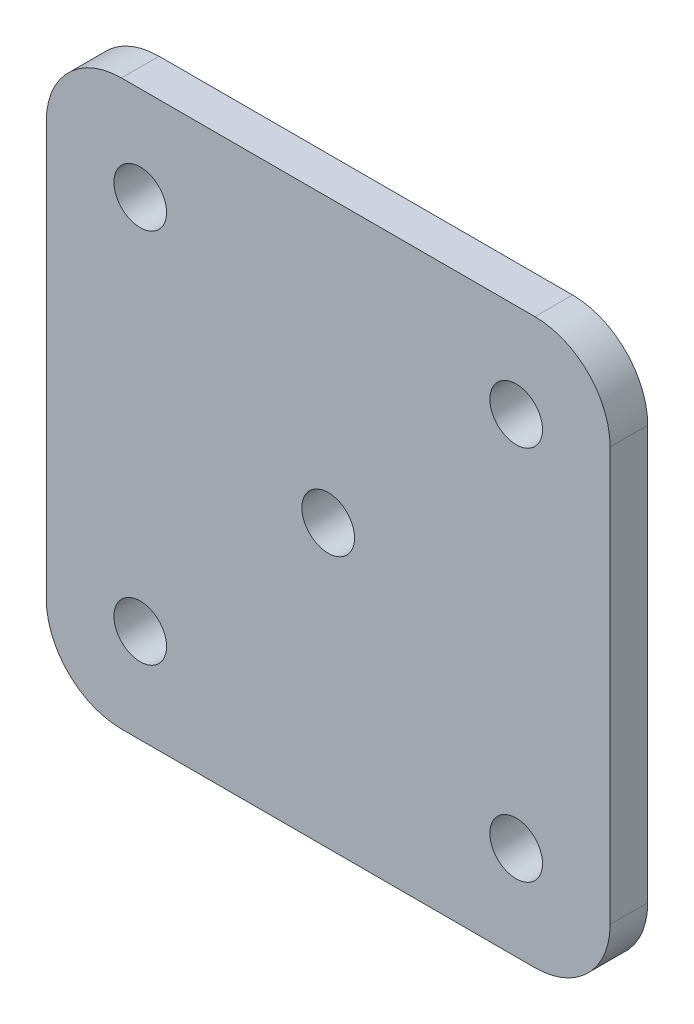
ISO-10303-21;
HEADER;
FILE_DESCRIPTION(('STEP AP214'),'2;1');
FILE_NAME('part.step','',(''),(''),'','','');
FILE_SCHEMA(('AUTOMOTIVE_DESIGN { 1 0 10303 214 1 1 1 1 }'));
ENDSEC;
DATA;
#1=APPLICATION_CONTEXT('core data for automotive mechanical design processes');
#2=APPLICATION_PROTOCOL_DEFINITION('international standard','automotive_design',2000,#1);
#3=PRODUCT_CONTEXT('',#1,'mechanical');
#4=PRODUCT('Part','Part','',(#3));
#5=PRODUCT_RELATED_PRODUCT_CATEGORY('part','',(#4));
#6=PRODUCT_DEFINITION_FORMATION('','',#4);
#7=PRODUCT_DEFINITION_CONTEXT('part definition',#1,'design');
#8=PRODUCT_DEFINITION('design','',#6,#7);
#9=PRODUCT_DEFINITION_SHAPE('','',#8);
#10=(LENGTH_UNIT() NAMED_UNIT(*) SI_UNIT(.MILLI.,.METRE.));
#11=(NAMED_UNIT(*) PLANE_ANGLE_UNIT() SI_UNIT($,.RADIAN.));
#12=(NAMED_UNIT(*) SI_UNIT($,.STERADIAN.) SOLID_ANGLE_UNIT());
#13=UNCERTAINTY_MEASURE_WITH_UNIT(LENGTH_MEASURE(1.E-05),#10,'distance_accuracy_value','');
#14=(GEOMETRIC_REPRESENTATION_CONTEXT(3) GLOBAL_UNCERTAINTY_ASSIGNED_CONTEXT((#13)) GLOBAL_UNIT_ASSIGNED_CONTEXT((#10,
#11,#12)) REPRESENTATION_CONTEXT('',''));
#15=CARTESIAN_POINT('',(0.,0.,0.));
#16=DIRECTION('',(0.,0.,1.));
#17=DIRECTION('',(1.,0.,0.));
#18=AXIS2_PLACEMENT_3D('',#15,#16,#17);
#19=CARTESIAN_POINT('',(-37.5,37.5,5.));
#20=DIRECTION('',(1.,0.,0.));
#21=DIRECTION('',(0.,1.,0.));
#22=AXIS2_PLACEMENT_3D('',#19,#20,#21);
#23=PLANE('',#22);
#24=DIRECTION('',(0.,-1.,0.));
#25=VECTOR('',#24,1.);
#26=CARTESIAN_POINT('',(-37.5,37.5,5.));
#27=LINE('',#26,#25);
#28=CARTESIAN_POINT('',(-37.5,27.5,5.));
#29=VERTEX_POINT('',#28);
#30=CARTESIAN_POINT('',(-37.5,-27.5,5.));
#31=VERTEX_POINT('',#30);
#32=EDGE_CURVE('E123',#29,#31,#27,.T.);
#33=ORIENTED_EDGE('',*,*,#32,.F.);
#34=DIRECTION('',(0.,0.,-1.));
#35=VECTOR('',#34,1.);
#36=CARTESIAN_POINT('',(-37.5,27.5,5.));
#37=LINE('',#36,#35);
#38=CARTESIAN_POINT('',(-37.5,27.5,0.));
#39=VERTEX_POINT('',#38);
#40=EDGE_CURVE('E108',#29,#39,#37,.T.);
#41=ORIENTED_EDGE('',*,*,#40,.T.);
#42=DIRECTION('',(0.,-1.,0.));
#43=VECTOR('',#42,1.);
#44=CARTESIAN_POINT('',(-37.5,37.5,0.));
#45=LINE('',#44,#43);
#46=CARTESIAN_POINT('',(-37.5,-27.5,0.));
#47=VERTEX_POINT('',#46);
#48=EDGE_CURVE('E120',#39,#47,#45,.T.);
#49=ORIENTED_EDGE('',*,*,#48,.T.);
#50=DIRECTION('',(0.,0.,-1.));
#51=VECTOR('',#50,1.);
#52=CARTESIAN_POINT('',(-37.5,-27.5,5.));
#53=LINE('',#52,#51);
#54=EDGE_CURVE('E125',#47,#31,#53,.F.);
#55=ORIENTED_EDGE('',*,*,#54,.T.);
#56=EDGE_LOOP('',(#33,#41,#49,#55));
#57=FACE_BOUND('',#56,.T.);
#58=ADVANCED_FACE('F38',(#57),#23,.F.);
#59=CARTESIAN_POINT('',(-37.5,-37.5,5.));
#60=DIRECTION('',(0.,1.,0.));
#61=DIRECTION('',(-1.,0.,0.));
#62=AXIS2_PLACEMENT_3D('',#59,#60,#61);
#63=PLANE('',#62);
#64=DIRECTION('',(1.,0.,0.));
#65=VECTOR('',#64,1.);
#66=CARTESIAN_POINT('',(-37.5,-37.5,5.));
#67=LINE('',#66,#65);
#68=CARTESIAN_POINT('',(-27.5,-37.5,5.));
#69=VERTEX_POINT('',#68);
#70=CARTESIAN_POINT('',(27.5,-37.5,5.));
#71=VERTEX_POINT('',#70);
#72=EDGE_CURVE('E169',#69,#71,#67,.T.);
#73=ORIENTED_EDGE('',*,*,#72,.F.);
#74=DIRECTION('',(0.,0.,-1.));
#75=VECTOR('',#74,1.);
#76=CARTESIAN_POINT('',(-27.5,-37.5,5.));
#77=LINE('',#76,#75);
#78=CARTESIAN_POINT('',(-27.5,-37.5,0.));
#79=VERTEX_POINT('',#78);
#80=EDGE_CURVE('E162',#69,#79,#77,.T.);
#81=ORIENTED_EDGE('',*,*,#80,.T.);
#82=DIRECTION('',(1.,0.,0.));
#83=VECTOR('',#82,1.);
#84=CARTESIAN_POINT('',(-37.5,-37.5,0.));
#85=LINE('',#84,#83);
#86=CARTESIAN_POINT('',(27.5,-37.5,0.));
#87=VERTEX_POINT('',#86);
#88=EDGE_CURVE('E129',#79,#87,#85,.T.);
#89=ORIENTED_EDGE('',*,*,#88,.T.);
#90=DIRECTION('',(0.,0.,-1.));
#91=VECTOR('',#90,1.);
#92=CARTESIAN_POINT('',(27.5,-37.5,5.));
#93=LINE('',#92,#91);
#94=EDGE_CURVE('E160',#87,#71,#93,.F.);
#95=ORIENTED_EDGE('',*,*,#94,.T.);
#96=EDGE_LOOP('',(#73,#81,#89,#95));
#97=FACE_BOUND('',#96,.T.);
#98=ADVANCED_FACE('F167',(#97),#63,.F.);
#99=CARTESIAN_POINT('',(37.5,37.5,5.));
#100=DIRECTION('',(-1.,0.,0.));
#101=DIRECTION('',(0.,0.,1.));
#102=AXIS2_PLACEMENT_3D('',#99,#100,#101);
#103=PLANE('',#102);
#104=DIRECTION('',(0.,1.,0.));
#105=VECTOR('',#104,1.);
#106=CARTESIAN_POINT('',(37.5,37.5,5.));
#107=LINE('',#106,#105);
#108=CARTESIAN_POINT('',(37.5,-27.5,5.));
#109=VERTEX_POINT('',#108);
#110=CARTESIAN_POINT('',(37.5,27.5,5.));
#111=VERTEX_POINT('',#110);
#112=EDGE_CURVE('E177',#109,#111,#107,.T.);
#113=ORIENTED_EDGE('',*,*,#112,.F.);
#114=DIRECTION('',(0.,0.,-1.));
#115=VECTOR('',#114,1.);
#116=CARTESIAN_POINT('',(37.5,-27.5,5.));
#117=LINE('',#116,#115);
#118=CARTESIAN_POINT('',(37.5,-27.5,0.));
#119=VERTEX_POINT('',#118);
#120=EDGE_CURVE('E11',#109,#119,#117,.T.);
#121=ORIENTED_EDGE('',*,*,#120,.T.);
#122=DIRECTION('',(0.,1.,0.));
#123=VECTOR('',#122,1.);
#124=CARTESIAN_POINT('',(37.5,37.5,0.));
#125=LINE('',#124,#123);
#126=CARTESIAN_POINT('',(37.5,27.5,0.));
#127=VERTEX_POINT('',#126);
#128=EDGE_CURVE('E133',#119,#127,#125,.T.);
#129=ORIENTED_EDGE('',*,*,#128,.T.);
#130=DIRECTION('',(0.,0.,-1.));
#131=VECTOR('',#130,1.);
#132=CARTESIAN_POINT('',(37.5,27.5,5.));
#133=LINE('',#132,#131);
#134=EDGE_CURVE('E46',#127,#111,#133,.F.);
#135=ORIENTED_EDGE('',*,*,#134,.T.);
#136=EDGE_LOOP('',(#113,#121,#129,#135));
#137=FACE_BOUND('',#136,.T.);
#138=ADVANCED_FACE('F176',(#137),#103,.F.);
#139=CARTESIAN_POINT('',(-37.5,37.5,5.));
#140=DIRECTION('',(0.,-1.,0.));
#141=DIRECTION('',(1.,0.,0.));
#142=AXIS2_PLACEMENT_3D('',#139,#140,#141);
#143=PLANE('',#142);
#144=DIRECTION('',(-1.,0.,0.));
#145=VECTOR('',#144,1.);
#146=CARTESIAN_POINT('',(-37.5,37.5,0.));
#147=LINE('',#146,#145);
#148=CARTESIAN_POINT('',(27.5,37.5,0.));
#149=VERTEX_POINT('',#148);
#150=CARTESIAN_POINT('',(-27.5,37.5,0.));
#151=VERTEX_POINT('',#150);
#152=EDGE_CURVE('E143',#149,#151,#147,.T.);
#153=ORIENTED_EDGE('',*,*,#152,.T.);
#154=DIRECTION('',(0.,0.,-1.));
#155=VECTOR('',#154,1.);
#156=CARTESIAN_POINT('',(-27.5,37.5,5.));
#157=LINE('',#156,#155);
#158=CARTESIAN_POINT('',(-27.5,37.5,5.));
#159=VERTEX_POINT('',#158);
#160=EDGE_CURVE('E109',#151,#159,#157,.F.);
#161=ORIENTED_EDGE('',*,*,#160,.T.);
#162=DIRECTION('',(-1.,0.,0.));
#163=VECTOR('',#162,1.);
#164=CARTESIAN_POINT('',(-37.5,37.5,5.));
#165=LINE('',#164,#163);
#166=CARTESIAN_POINT('',(27.5,37.5,5.));
#167=VERTEX_POINT('',#166);
#168=EDGE_CURVE('E139',#167,#159,#165,.T.);
#169=ORIENTED_EDGE('',*,*,#168,.F.);
#170=DIRECTION('',(0.,0.,-1.));
#171=VECTOR('',#170,1.);
#172=CARTESIAN_POINT('',(27.5,37.5,5.));
#173=LINE('',#172,#171);
#174=EDGE_CURVE('E114',#167,#149,#173,.T.);
#175=ORIENTED_EDGE('',*,*,#174,.T.);
#176=EDGE_LOOP('',(#153,#161,#169,#175));
#177=FACE_BOUND('',#176,.T.);
#178=ADVANCED_FACE('F215',(#177),#143,.F.);
#179=CARTESIAN_POINT('',(0.,0.,5.));
#180=DIRECTION('',(0.,0.,1.));
#181=DIRECTION('',(1.,0.,0.));
#182=AXIS2_PLACEMENT_3D('',#179,#180,#181);
#183=PLANE('',#182);
#184=CARTESIAN_POINT('',(0.,0.,5.));
#185=DIRECTION('',(0.,0.,1.));
#186=DIRECTION('',(1.,0.,0.));
#187=AXIS2_PLACEMENT_3D('',#184,#185,#186);
#188=CIRCLE('',#187,3.5);
#189=CARTESIAN_POINT('',(3.5,0.,5.));
#190=VERTEX_POINT('',#189);
#191=EDGE_CURVE('E206',#190,#190,#188,.T.);
#192=ORIENTED_EDGE('',*,*,#191,.F.);
#193=EDGE_LOOP('',(#192));
#194=FACE_BOUND('',#193,.T.);
#195=CARTESIAN_POINT('',(-25.,25.,5.));
#196=DIRECTION('',(0.,0.,1.));
#197=DIRECTION('',(1.,0.,0.));
#198=AXIS2_PLACEMENT_3D('',#195,#196,#197);
#199=CIRCLE('',#198,3.5);
#200=CARTESIAN_POINT('',(-21.5,25.,5.));
#201=VERTEX_POINT('',#200);
#202=EDGE_CURVE('E200',#201,#201,#199,.T.);
#203=ORIENTED_EDGE('',*,*,#202,.F.);
#204=EDGE_LOOP('',(#203));
#205=FACE_BOUND('',#204,.T.);
#206=CARTESIAN_POINT('',(-25.,-25.,5.));
#207=DIRECTION('',(0.,0.,1.));
#208=DIRECTION('',(1.,0.,0.));
#209=AXIS2_PLACEMENT_3D('',#206,#207,#208);
#210=CIRCLE('',#209,3.5);
#211=CARTESIAN_POINT('',(-21.5,-25.,5.));
#212=VERTEX_POINT('',#211);
#213=EDGE_CURVE('E194',#212,#212,#210,.T.);
#214=ORIENTED_EDGE('',*,*,#213,.F.);
#215=EDGE_LOOP('',(#214));
#216=FACE_BOUND('',#215,.T.);
#217=CARTESIAN_POINT('',(25.,-25.,5.));
#218=DIRECTION('',(0.,0.,1.));
#219=DIRECTION('',(1.,0.,0.));
#220=AXIS2_PLACEMENT_3D('',#217,#218,#219);
#221=CIRCLE('',#220,3.5);
#222=CARTESIAN_POINT('',(28.5,-25.,5.));
#223=VERTEX_POINT('',#222);
#224=EDGE_CURVE('E188',#223,#223,#221,.T.);
#225=ORIENTED_EDGE('',*,*,#224,.F.);
#226=EDGE_LOOP('',(#225));
#227=FACE_BOUND('',#226,.T.);
#228=CARTESIAN_POINT('',(25.,25.,5.));
#229=DIRECTION('',(0.,0.,1.));
#230=DIRECTION('',(1.,0.,0.));
#231=AXIS2_PLACEMENT_3D('',#228,#229,#230);
#232=CIRCLE('',#231,3.5);
#233=CARTESIAN_POINT('',(28.5,25.,5.));
#234=VERTEX_POINT('',#233);
#235=EDGE_CURVE('E136',#234,#234,#232,.T.);
#236=ORIENTED_EDGE('',*,*,#235,.F.);
#237=EDGE_LOOP('',(#236));
#238=FACE_BOUND('',#237,.T.);
#239=ORIENTED_EDGE('',*,*,#168,.T.);
#240=CARTESIAN_POINT('',(-27.5,27.5,5.));
#241=DIRECTION('',(0.,0.,1.));
#242=DIRECTION('',(1.,0.,0.));
#243=AXIS2_PLACEMENT_3D('',#240,#241,#242);
#244=CIRCLE('',#243,10.);
#245=EDGE_CURVE('E158',#159,#29,#244,.T.);
#246=ORIENTED_EDGE('',*,*,#245,.T.);
#247=ORIENTED_EDGE('',*,*,#32,.T.);
#248=CARTESIAN_POINT('',(-27.5,-27.5,5.));
#249=DIRECTION('',(0.,0.,1.));
#250=DIRECTION('',(1.,0.,0.));
#251=AXIS2_PLACEMENT_3D('',#248,#249,#250);
#252=CIRCLE('',#251,10.);
#253=EDGE_CURVE('E156',#31,#69,#252,.T.);
#254=ORIENTED_EDGE('',*,*,#253,.T.);
#255=ORIENTED_EDGE('',*,*,#72,.T.);
#256=CARTESIAN_POINT('',(27.5,-27.5,5.));
#257=DIRECTION('',(0.,0.,1.));
#258=DIRECTION('',(1.,0.,0.));
#259=AXIS2_PLACEMENT_3D('',#256,#257,#258);
#260=CIRCLE('',#259,10.);
#261=EDGE_CURVE('E59',#71,#109,#260,.T.);
#262=ORIENTED_EDGE('',*,*,#261,.T.);
#263=ORIENTED_EDGE('',*,*,#112,.T.);
#264=CARTESIAN_POINT('',(27.5,27.5,5.));
#265=DIRECTION('',(0.,0.,1.));
#266=DIRECTION('',(1.,0.,0.));
#267=AXIS2_PLACEMENT_3D('',#264,#265,#266);
#268=CIRCLE('',#267,10.);
#269=EDGE_CURVE('E153',#111,#167,#268,.T.);
#270=ORIENTED_EDGE('',*,*,#269,.T.);
#271=EDGE_LOOP('',(#239,#246,#247,#254,#255,#262,#263,#270));
#272=FACE_BOUND('',#271,.T.);
#273=ADVANCED_FACE('F212',(#194,#205,#216,#227,#238,#272),#183,.T.);
#274=CARTESIAN_POINT('',(0.,0.,0.));
#275=DIRECTION('',(0.,0.,1.));
#276=DIRECTION('',(1.,0.,0.));
#277=AXIS2_PLACEMENT_3D('',#274,#275,#276);
#278=PLANE('',#277);
#279=CARTESIAN_POINT('',(0.,0.,0.));
#280=DIRECTION('',(0.,0.,1.));
#281=DIRECTION('',(1.,0.,0.));
#282=AXIS2_PLACEMENT_3D('',#279,#280,#281);
#283=CIRCLE('',#282,3.5);
#284=CARTESIAN_POINT('',(3.5,0.,0.));
#285=VERTEX_POINT('',#284);
#286=EDGE_CURVE('E203',#285,#285,#283,.T.);
#287=ORIENTED_EDGE('',*,*,#286,.T.);
#288=EDGE_LOOP('',(#287));
#289=FACE_BOUND('',#288,.T.);
#290=CARTESIAN_POINT('',(-25.,25.,0.));
#291=DIRECTION('',(0.,0.,1.));
#292=DIRECTION('',(1.,0.,0.));
#293=AXIS2_PLACEMENT_3D('',#290,#291,#292);
#294=CIRCLE('',#293,3.5);
#295=CARTESIAN_POINT('',(-21.5,25.,0.));
#296=VERTEX_POINT('',#295);
#297=EDGE_CURVE('E197',#296,#296,#294,.T.);
#298=ORIENTED_EDGE('',*,*,#297,.T.);
#299=EDGE_LOOP('',(#298));
#300=FACE_BOUND('',#299,.T.);
#301=CARTESIAN_POINT('',(-25.,-25.,0.));
#302=DIRECTION('',(0.,0.,1.));
#303=DIRECTION('',(1.,0.,0.));
#304=AXIS2_PLACEMENT_3D('',#301,#302,#303);
#305=CIRCLE('',#304,3.5);
#306=CARTESIAN_POINT('',(-21.5,-25.,0.));
#307=VERTEX_POINT('',#306);
#308=EDGE_CURVE('E191',#307,#307,#305,.T.);
#309=ORIENTED_EDGE('',*,*,#308,.T.);
#310=EDGE_LOOP('',(#309));
#311=FACE_BOUND('',#310,.T.);
#312=CARTESIAN_POINT('',(25.,-25.,0.));
#313=DIRECTION('',(0.,0.,1.));
#314=DIRECTION('',(1.,0.,0.));
#315=AXIS2_PLACEMENT_3D('',#312,#313,#314);
#316=CIRCLE('',#315,3.5);
#317=CARTESIAN_POINT('',(28.5,-25.,0.));
#318=VERTEX_POINT('',#317);
#319=EDGE_CURVE('E185',#318,#318,#316,.T.);
#320=ORIENTED_EDGE('',*,*,#319,.T.);
#321=EDGE_LOOP('',(#320));
#322=FACE_BOUND('',#321,.T.);
#323=CARTESIAN_POINT('',(25.,25.,0.));
#324=DIRECTION('',(0.,0.,1.));
#325=DIRECTION('',(1.,0.,0.));
#326=AXIS2_PLACEMENT_3D('',#323,#324,#325);
#327=CIRCLE('',#326,3.5);
#328=CARTESIAN_POINT('',(28.5,25.,0.));
#329=VERTEX_POINT('',#328);
#330=EDGE_CURVE('E130',#329,#329,#327,.T.);
#331=ORIENTED_EDGE('',*,*,#330,.T.);
#332=EDGE_LOOP('',(#331));
#333=FACE_BOUND('',#332,.T.);
#334=ORIENTED_EDGE('',*,*,#48,.F.);
#335=CARTESIAN_POINT('',(-27.5,27.5,0.));
#336=DIRECTION('',(0.,0.,1.));
#337=DIRECTION('',(1.,0.,0.));
#338=AXIS2_PLACEMENT_3D('',#335,#336,#337);
#339=CIRCLE('',#338,10.);
#340=EDGE_CURVE('E104',#39,#151,#339,.F.);
#341=ORIENTED_EDGE('',*,*,#340,.T.);
#342=ORIENTED_EDGE('',*,*,#152,.F.);
#343=CARTESIAN_POINT('',(27.5,27.5,0.));
#344=DIRECTION('',(0.,0.,1.));
#345=DIRECTION('',(1.,0.,0.));
#346=AXIS2_PLACEMENT_3D('',#343,#344,#345);
#347=CIRCLE('',#346,10.);
#348=EDGE_CURVE('E124',#149,#127,#347,.F.);
#349=ORIENTED_EDGE('',*,*,#348,.T.);
#350=ORIENTED_EDGE('',*,*,#128,.F.);
#351=CARTESIAN_POINT('',(27.5,-27.5,0.));
#352=DIRECTION('',(0.,0.,1.));
#353=DIRECTION('',(1.,0.,0.));
#354=AXIS2_PLACEMENT_3D('',#351,#352,#353);
#355=CIRCLE('',#354,10.);
#356=EDGE_CURVE('E147',#119,#87,#355,.F.);
#357=ORIENTED_EDGE('',*,*,#356,.T.);
#358=ORIENTED_EDGE('',*,*,#88,.F.);
#359=CARTESIAN_POINT('',(-27.5,-27.5,0.));
#360=DIRECTION('',(0.,0.,1.));
#361=DIRECTION('',(1.,0.,0.));
#362=AXIS2_PLACEMENT_3D('',#359,#360,#361);
#363=CIRCLE('',#362,10.);
#364=EDGE_CURVE('E115',#79,#47,#363,.F.);
#365=ORIENTED_EDGE('',*,*,#364,.T.);
#366=EDGE_LOOP('',(#334,#341,#342,#349,#350,#357,#358,#365));
#367=FACE_BOUND('',#366,.T.);
#368=ADVANCED_FACE('F127',(#289,#300,#311,#322,#333,#367),#278,.F.);
#369=CARTESIAN_POINT('',(25.,25.,5.));
#370=DIRECTION('',(0.,0.,1.));
#371=DIRECTION('',(1.,0.,0.));
#372=AXIS2_PLACEMENT_3D('',#369,#370,#371);
#373=CYLINDRICAL_SURFACE('',#372,3.5);
#374=ORIENTED_EDGE('',*,*,#330,.F.);
#375=EDGE_LOOP('',(#374));
#376=FACE_BOUND('',#375,.T.);
#377=ORIENTED_EDGE('',*,*,#235,.T.);
#378=EDGE_LOOP('',(#377));
#379=FACE_BOUND('',#378,.T.);
#380=ADVANCED_FACE('F279',(#376,#379),#373,.F.);
#381=CARTESIAN_POINT('',(25.,-25.,5.));
#382=DIRECTION('',(0.,0.,1.));
#383=DIRECTION('',(1.,0.,0.));
#384=AXIS2_PLACEMENT_3D('',#381,#382,#383);
#385=CYLINDRICAL_SURFACE('',#384,3.5);
#386=ORIENTED_EDGE('',*,*,#319,.F.);
#387=EDGE_LOOP('',(#386));
#388=FACE_BOUND('',#387,.T.);
#389=ORIENTED_EDGE('',*,*,#224,.T.);
#390=EDGE_LOOP('',(#389));
#391=FACE_BOUND('',#390,.T.);
#392=ADVANCED_FACE('F294',(#388,#391),#385,.F.);
#393=CARTESIAN_POINT('',(-25.,-25.,5.));
#394=DIRECTION('',(0.,0.,1.));
#395=DIRECTION('',(1.,0.,0.));
#396=AXIS2_PLACEMENT_3D('',#393,#394,#395);
#397=CYLINDRICAL_SURFACE('',#396,3.5);
#398=ORIENTED_EDGE('',*,*,#308,.F.);
#399=EDGE_LOOP('',(#398));
#400=FACE_BOUND('',#399,.T.);
#401=ORIENTED_EDGE('',*,*,#213,.T.);
#402=EDGE_LOOP('',(#401));
#403=FACE_BOUND('',#402,.T.);
#404=ADVANCED_FACE('F301',(#400,#403),#397,.F.);
#405=CARTESIAN_POINT('',(-25.,25.,5.));
#406=DIRECTION('',(0.,0.,1.));
#407=DIRECTION('',(1.,0.,0.));
#408=AXIS2_PLACEMENT_3D('',#405,#406,#407);
#409=CYLINDRICAL_SURFACE('',#408,3.5);
#410=ORIENTED_EDGE('',*,*,#297,.F.);
#411=EDGE_LOOP('',(#410));
#412=FACE_BOUND('',#411,.T.);
#413=ORIENTED_EDGE('',*,*,#202,.T.);
#414=EDGE_LOOP('',(#413));
#415=FACE_BOUND('',#414,.T.);
#416=ADVANCED_FACE('F246',(#412,#415),#409,.F.);
#417=CARTESIAN_POINT('',(-27.5,27.5,5.));
#418=DIRECTION('',(0.,0.,-1.));
#419=DIRECTION('',(-1.,0.,0.));
#420=AXIS2_PLACEMENT_3D('',#417,#418,#419);
#421=CYLINDRICAL_SURFACE('',#420,10.);
#422=ORIENTED_EDGE('',*,*,#245,.F.);
#423=ORIENTED_EDGE('',*,*,#160,.F.);
#424=ORIENTED_EDGE('',*,*,#340,.F.);
#425=ORIENTED_EDGE('',*,*,#40,.F.);
#426=EDGE_LOOP('',(#422,#423,#424,#425));
#427=FACE_BOUND('',#426,.T.);
#428=ADVANCED_FACE('F107',(#427),#421,.T.);
#429=CARTESIAN_POINT('',(-27.5,-27.5,5.));
#430=DIRECTION('',(0.,0.,-1.));
#431=DIRECTION('',(-1.,0.,0.));
#432=AXIS2_PLACEMENT_3D('',#429,#430,#431);
#433=CYLINDRICAL_SURFACE('',#432,10.);
#434=ORIENTED_EDGE('',*,*,#253,.F.);
#435=ORIENTED_EDGE('',*,*,#54,.F.);
#436=ORIENTED_EDGE('',*,*,#364,.F.);
#437=ORIENTED_EDGE('',*,*,#80,.F.);
#438=EDGE_LOOP('',(#434,#435,#436,#437));
#439=FACE_BOUND('',#438,.T.);
#440=ADVANCED_FACE('F235',(#439),#433,.T.);
#441=CARTESIAN_POINT('',(27.5,-27.5,5.));
#442=DIRECTION('',(0.,0.,-1.));
#443=DIRECTION('',(-1.,0.,0.));
#444=AXIS2_PLACEMENT_3D('',#441,#442,#443);
#445=CYLINDRICAL_SURFACE('',#444,10.);
#446=ORIENTED_EDGE('',*,*,#261,.F.);
#447=ORIENTED_EDGE('',*,*,#94,.F.);
#448=ORIENTED_EDGE('',*,*,#356,.F.);
#449=ORIENTED_EDGE('',*,*,#120,.F.);
#450=EDGE_LOOP('',(#446,#447,#448,#449));
#451=FACE_BOUND('',#450,.T.);
#452=ADVANCED_FACE('F175',(#451),#445,.T.);
#453=CARTESIAN_POINT('',(27.5,27.5,5.));
#454=DIRECTION('',(0.,0.,-1.));
#455=DIRECTION('',(-1.,0.,0.));
#456=AXIS2_PLACEMENT_3D('',#453,#454,#455);
#457=CYLINDRICAL_SURFACE('',#456,10.);
#458=ORIENTED_EDGE('',*,*,#269,.F.);
#459=ORIENTED_EDGE('',*,*,#134,.F.);
#460=ORIENTED_EDGE('',*,*,#348,.F.);
#461=ORIENTED_EDGE('',*,*,#174,.F.);
#462=EDGE_LOOP('',(#458,#459,#460,#461));
#463=FACE_BOUND('',#462,.T.);
#464=ADVANCED_FACE('F40',(#463),#457,.T.);
#465=CARTESIAN_POINT('',(0.,0.,5.));
#466=DIRECTION('',(0.,0.,1.));
#467=DIRECTION('',(1.,0.,0.));
#468=AXIS2_PLACEMENT_3D('',#465,#466,#467);
#469=CYLINDRICAL_SURFACE('',#468,3.5);
#470=ORIENTED_EDGE('',*,*,#286,.F.);
#471=EDGE_LOOP('',(#470));
#472=FACE_BOUND('',#471,.T.);
#473=ORIENTED_EDGE('',*,*,#191,.T.);
#474=EDGE_LOOP('',(#473));
#475=FACE_BOUND('',#474,.T.);
#476=ADVANCED_FACE('F210',(#472,#475),#469,.F.);
#477=CLOSED_SHELL('',(#58,#98,#138,#178,#273,#368,#380,#392,#404,#416,#428,#440,#452,#464,#476));
#478=MANIFOLD_SOLID_BREP('B2',#477);
#479=ADVANCED_BREP_SHAPE_REPRESENTATION('',(#18,#478),#14);
#480=SHAPE_DEFINITION_REPRESENTATION(#9,#479);
ENDSEC;
END-ISO-10303-21;
